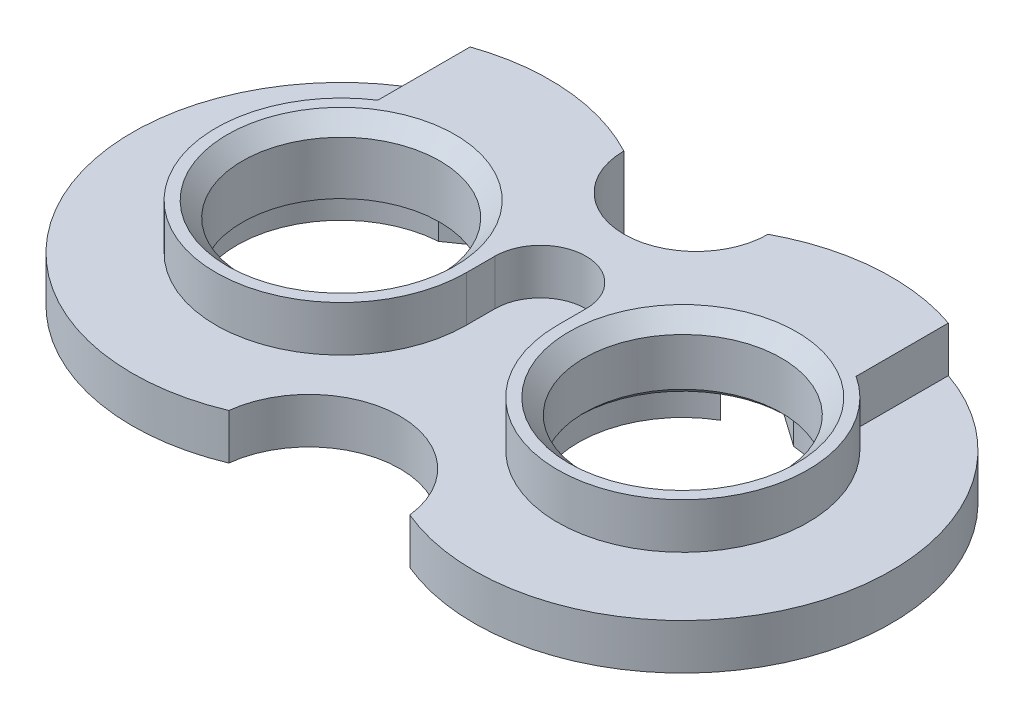
ISO-10303-21;
HEADER;
FILE_DESCRIPTION(('STEP AP214'),'2;1');
FILE_NAME('part.step','',(''),(''),'','','');
FILE_SCHEMA(('AUTOMOTIVE_DESIGN { 1 0 10303 214 1 1 1 1 }'));
ENDSEC;
DATA;
#1=APPLICATION_CONTEXT('core data for automotive mechanical design processes');
#2=APPLICATION_PROTOCOL_DEFINITION('international standard','automotive_design',2000,#1);
#3=PRODUCT_CONTEXT('',#1,'mechanical');
#4=PRODUCT('Part','Part','',(#3));
#5=PRODUCT_RELATED_PRODUCT_CATEGORY('part','',(#4));
#6=PRODUCT_DEFINITION_FORMATION('','',#4);
#7=PRODUCT_DEFINITION_CONTEXT('part definition',#1,'design');
#8=PRODUCT_DEFINITION('design','',#6,#7);
#9=PRODUCT_DEFINITION_SHAPE('','',#8);
#10=(LENGTH_UNIT() NAMED_UNIT(*) SI_UNIT(.MILLI.,.METRE.));
#11=(NAMED_UNIT(*) PLANE_ANGLE_UNIT() SI_UNIT($,.RADIAN.));
#12=(NAMED_UNIT(*) SI_UNIT($,.STERADIAN.) SOLID_ANGLE_UNIT());
#13=UNCERTAINTY_MEASURE_WITH_UNIT(LENGTH_MEASURE(1.E-05),#10,'distance_accuracy_value','');
#14=(GEOMETRIC_REPRESENTATION_CONTEXT(3) GLOBAL_UNCERTAINTY_ASSIGNED_CONTEXT((#13)) GLOBAL_UNIT_ASSIGNED_CONTEXT((#10,
#11,#12)) REPRESENTATION_CONTEXT('',''));
#15=CARTESIAN_POINT('',(0.,0.,0.));
#16=DIRECTION('',(0.,0.,1.));
#17=DIRECTION('',(1.,0.,0.));
#18=AXIS2_PLACEMENT_3D('',#15,#16,#17);
#19=CARTESIAN_POINT('',(22.5,12.,0.));
#20=DIRECTION('',(0.,-1.,0.));
#21=DIRECTION('',(0.,0.,-1.));
#22=AXIS2_PLACEMENT_3D('',#19,#20,#21);
#23=CYLINDRICAL_SURFACE('',#22,13.);
#24=CARTESIAN_POINT('',(22.5,3.75,0.));
#25=DIRECTION('',(0.,1.,0.));
#26=DIRECTION('',(0.,0.,1.));
#27=AXIS2_PLACEMENT_3D('',#24,#25,#26);
#28=CIRCLE('',#27,13.);
#29=CARTESIAN_POINT('',(22.5,3.75,13.));
#30=VERTEX_POINT('',#29);
#31=EDGE_CURVE('E11',#30,#30,#28,.F.);
#32=ORIENTED_EDGE('',*,*,#31,.T.);
#33=EDGE_LOOP('',(#32));
#34=FACE_BOUND('',#33,.T.);
#35=CARTESIAN_POINT('',(22.5,10.,0.));
#36=DIRECTION('',(0.,1.,0.));
#37=DIRECTION('',(0.,0.,1.));
#38=AXIS2_PLACEMENT_3D('',#35,#36,#37);
#39=CIRCLE('',#38,13.);
#40=CARTESIAN_POINT('',(22.5,10.,13.));
#41=VERTEX_POINT('',#40);
#42=EDGE_CURVE('E214',#41,#41,#39,.T.);
#43=ORIENTED_EDGE('',*,*,#42,.T.);
#44=EDGE_LOOP('',(#43));
#45=FACE_BOUND('',#44,.T.);
#46=ADVANCED_FACE('F34',(#34,#45),#23,.F.);
#47=CARTESIAN_POINT('',(-22.5,12.,0.));
#48=DIRECTION('',(0.,-1.,0.));
#49=DIRECTION('',(0.,0.,-1.));
#50=AXIS2_PLACEMENT_3D('',#47,#48,#49);
#51=CYLINDRICAL_SURFACE('',#50,13.);
#52=CARTESIAN_POINT('',(-22.5,10.,0.));
#53=DIRECTION('',(0.,1.,0.));
#54=DIRECTION('',(0.,0.,1.));
#55=AXIS2_PLACEMENT_3D('',#52,#53,#54);
#56=CIRCLE('',#55,13.);
#57=CARTESIAN_POINT('',(-22.5,10.,13.));
#58=VERTEX_POINT('',#57);
#59=EDGE_CURVE('E203',#58,#58,#56,.T.);
#60=ORIENTED_EDGE('',*,*,#59,.T.);
#61=EDGE_LOOP('',(#60));
#62=FACE_BOUND('',#61,.T.);
#63=CARTESIAN_POINT('',(-22.5,3.,0.));
#64=DIRECTION('',(0.,-1.,0.));
#65=DIRECTION('',(0.,0.,-1.));
#66=AXIS2_PLACEMENT_3D('',#63,#64,#65);
#67=CIRCLE('',#66,13.);
#68=CARTESIAN_POINT('',(-22.5,3.,-13.));
#69=VERTEX_POINT('',#68);
#70=EDGE_CURVE('E201',#69,#69,#67,.T.);
#71=ORIENTED_EDGE('',*,*,#70,.T.);
#72=EDGE_LOOP('',(#71));
#73=FACE_BOUND('',#72,.T.);
#74=ADVANCED_FACE('F411',(#62,#73),#51,.F.);
#75=CARTESIAN_POINT('',(0.,12.,0.));
#76=DIRECTION('',(0.,1.,0.));
#77=DIRECTION('',(0.,0.,1.));
#78=AXIS2_PLACEMENT_3D('',#75,#76,#77);
#79=PLANE('',#78);
#80=CARTESIAN_POINT('',(22.5,12.,0.));
#81=DIRECTION('',(0.,1.,0.));
#82=DIRECTION('',(0.,0.,1.));
#83=AXIS2_PLACEMENT_3D('',#80,#81,#82);
#84=CIRCLE('',#83,15.);
#85=CARTESIAN_POINT('',(22.5,12.,15.));
#86=VERTEX_POINT('',#85);
#87=EDGE_CURVE('E208',#86,#86,#84,.F.);
#88=ORIENTED_EDGE('',*,*,#87,.T.);
#89=EDGE_LOOP('',(#88));
#90=FACE_BOUND('',#89,.T.);
#91=CARTESIAN_POINT('',(-22.5,12.,0.));
#92=DIRECTION('',(0.,1.,0.));
#93=DIRECTION('',(0.,0.,1.));
#94=AXIS2_PLACEMENT_3D('',#91,#92,#93);
#95=CIRCLE('',#94,15.);
#96=CARTESIAN_POINT('',(-22.5,12.,15.));
#97=VERTEX_POINT('',#96);
#98=EDGE_CURVE('E211',#97,#97,#95,.F.);
#99=ORIENTED_EDGE('',*,*,#98,.T.);
#100=EDGE_LOOP('',(#99));
#101=FACE_BOUND('',#100,.T.);
#102=DIRECTION('',(0.,0.,1.));
#103=VECTOR('',#102,1.);
#104=CARTESIAN_POINT('',(31.5,12.,-40.));
#105=LINE('',#104,#103);
#106=CARTESIAN_POINT('',(31.5,12.,-25.9855729203726));
#107=VERTEX_POINT('',#106);
#108=CARTESIAN_POINT('',(31.5,12.,-13.8293166859393));
#109=VERTEX_POINT('',#108);
#110=EDGE_CURVE('E284',#107,#109,#105,.T.);
#111=ORIENTED_EDGE('',*,*,#110,.F.);
#112=CARTESIAN_POINT('',(22.5,12.,0.));
#113=DIRECTION('',(0.,1.,0.));
#114=DIRECTION('',(0.,0.,1.));
#115=AXIS2_PLACEMENT_3D('',#112,#113,#114);
#116=CIRCLE('',#115,27.5);
#117=CARTESIAN_POINT('',(9.4999852047791,12.,-24.2332336951559));
#118=VERTEX_POINT('',#117);
#119=EDGE_CURVE('E231',#107,#118,#116,.T.);
#120=ORIENTED_EDGE('',*,*,#119,.T.);
#121=CARTESIAN_POINT('',(0.,12.,-24.25));
#122=DIRECTION('',(0.,1.,0.));
#123=DIRECTION('',(0.,0.,1.));
#124=AXIS2_PLACEMENT_3D('',#121,#122,#123);
#125=CIRCLE('',#124,9.5);
#126=CARTESIAN_POINT('',(-9.4999852047791,12.,-24.2332336951559));
#127=VERTEX_POINT('',#126);
#128=EDGE_CURVE('E239',#127,#118,#125,.T.);
#129=ORIENTED_EDGE('',*,*,#128,.F.);
#130=CARTESIAN_POINT('',(-22.5,12.,0.));
#131=DIRECTION('',(0.,1.,0.));
#132=DIRECTION('',(0.,0.,1.));
#133=AXIS2_PLACEMENT_3D('',#130,#131,#132);
#134=CIRCLE('',#133,27.5);
#135=CARTESIAN_POINT('',(-31.5,12.,-25.9855729203726));
#136=VERTEX_POINT('',#135);
#137=EDGE_CURVE('E226',#127,#136,#134,.T.);
#138=ORIENTED_EDGE('',*,*,#137,.T.);
#139=DIRECTION('',(0.,0.,-1.));
#140=VECTOR('',#139,1.);
#141=CARTESIAN_POINT('',(-31.5,12.,-40.));
#142=LINE('',#141,#140);
#143=CARTESIAN_POINT('',(-31.5,12.,-13.8293166859393));
#144=VERTEX_POINT('',#143);
#145=EDGE_CURVE('E286',#144,#136,#142,.T.);
#146=ORIENTED_EDGE('',*,*,#145,.F.);
#147=CARTESIAN_POINT('',(-22.5,12.,0.));
#148=DIRECTION('',(0.,-1.,0.));
#149=DIRECTION('',(0.,0.,1.));
#150=AXIS2_PLACEMENT_3D('',#147,#148,#149);
#151=CIRCLE('',#150,16.5);
#152=CARTESIAN_POINT('',(-6.,12.,0.));
#153=VERTEX_POINT('',#152);
#154=EDGE_CURVE('E288',#153,#144,#151,.T.);
#155=ORIENTED_EDGE('',*,*,#154,.F.);
#156=DIRECTION('',(0.,0.,1.));
#157=VECTOR('',#156,1.);
#158=CARTESIAN_POINT('',(-6.,12.,0.));
#159=LINE('',#158,#157);
#160=CARTESIAN_POINT('',(-6.,12.,-3.75));
#161=VERTEX_POINT('',#160);
#162=EDGE_CURVE('E271',#161,#153,#159,.T.);
#163=ORIENTED_EDGE('',*,*,#162,.F.);
#164=CARTESIAN_POINT('',(0.,12.,-3.75));
#165=DIRECTION('',(0.,1.,0.));
#166=DIRECTION('',(0.,0.,-1.));
#167=AXIS2_PLACEMENT_3D('',#164,#165,#166);
#168=CIRCLE('',#167,6.);
#169=CARTESIAN_POINT('',(6.,12.,-3.75));
#170=VERTEX_POINT('',#169);
#171=EDGE_CURVE('E275',#170,#161,#168,.T.);
#172=ORIENTED_EDGE('',*,*,#171,.F.);
#173=DIRECTION('',(0.,0.,-1.));
#174=VECTOR('',#173,1.);
#175=CARTESIAN_POINT('',(6.,12.,0.));
#176=LINE('',#175,#174);
#177=CARTESIAN_POINT('',(6.,12.,0.));
#178=VERTEX_POINT('',#177);
#179=EDGE_CURVE('E278',#178,#170,#176,.T.);
#180=ORIENTED_EDGE('',*,*,#179,.F.);
#181=CARTESIAN_POINT('',(22.5,12.,0.));
#182=DIRECTION('',(0.,-1.,0.));
#183=DIRECTION('',(0.,0.,1.));
#184=AXIS2_PLACEMENT_3D('',#181,#182,#183);
#185=CIRCLE('',#184,16.5);
#186=EDGE_CURVE('E281',#109,#178,#185,.T.);
#187=ORIENTED_EDGE('',*,*,#186,.F.);
#188=EDGE_LOOP('',(#111,#120,#129,#138,#146,#155,#163,#172,#180,#187));
#189=FACE_BOUND('',#188,.T.);
#190=ADVANCED_FACE('F409',(#90,#101,#189),#79,.T.);
#191=CARTESIAN_POINT('',(0.,0.,0.));
#192=DIRECTION('',(0.,1.,0.));
#193=DIRECTION('',(0.,0.,1.));
#194=AXIS2_PLACEMENT_3D('',#191,#192,#193);
#195=PLANE('',#194);
#196=DIRECTION('',(-0.819152044288991,0.,-0.573576436351047));
#197=VECTOR('',#196,1.);
#198=CARTESIAN_POINT('',(4.55854138189374,0.,-19.585087734266));
#199=LINE('',#198,#197);
#200=CARTESIAN_POINT('',(15.5691090265812,0.,-11.8754052694879));
#201=VERTEX_POINT('',#200);
#202=CARTESIAN_POINT('',(7.02684365985484,0.,-17.8567638726575));
#203=VERTEX_POINT('',#202);
#204=EDGE_CURVE('E199',#201,#203,#199,.T.);
#205=ORIENTED_EDGE('',*,*,#204,.F.);
#206=CARTESIAN_POINT('',(22.5,0.,0.));
#207=DIRECTION('',(0.,-1.,0.));
#208=DIRECTION('',(0.,0.,-1.));
#209=AXIS2_PLACEMENT_3D('',#206,#207,#208);
#210=CIRCLE('',#209,13.75);
#211=CARTESIAN_POINT('',(23.3941559954784,0.,-13.7208959275898));
#212=VERTEX_POINT('',#211);
#213=EDGE_CURVE('E182',#212,#201,#210,.T.);
#214=ORIENTED_EDGE('',*,*,#213,.F.);
#215=DIRECTION('',(0.819152044288991,0.,0.573576436351047));
#216=VECTOR('',#215,1.);
#217=CARTESIAN_POINT('',(28.4788011072248,0.,-10.1605890912238));
#218=LINE('',#217,#216);
#219=CARTESIAN_POINT('',(9.46809189923089,0.,-23.4720309853739));
#220=VERTEX_POINT('',#219);
#221=EDGE_CURVE('E192',#220,#212,#218,.T.);
#222=ORIENTED_EDGE('',*,*,#221,.F.);
#223=CARTESIAN_POINT('',(0.,0.,-24.25));
#224=DIRECTION('',(0.,1.,0.));
#225=DIRECTION('',(0.,0.,1.));
#226=AXIS2_PLACEMENT_3D('',#223,#224,#225);
#227=CIRCLE('',#226,9.5);
#228=CARTESIAN_POINT('',(9.49998520477911,0.,-24.2332336951559));
#229=VERTEX_POINT('',#228);
#230=EDGE_CURVE('E219',#229,#220,#227,.F.);
#231=ORIENTED_EDGE('',*,*,#230,.F.);
#232=CARTESIAN_POINT('',(22.5,0.,0.));
#233=DIRECTION('',(0.,1.,0.));
#234=DIRECTION('',(0.,0.,1.));
#235=AXIS2_PLACEMENT_3D('',#232,#233,#234);
#236=CIRCLE('',#235,27.5);
#237=CARTESIAN_POINT('',(11.9220182875869,0.,25.3841742605871));
#238=VERTEX_POINT('',#237);
#239=EDGE_CURVE('E224',#238,#229,#236,.T.);
#240=ORIENTED_EDGE('',*,*,#239,.F.);
#241=CARTESIAN_POINT('',(0.,0.,26.75));
#242=DIRECTION('',(0.,1.,0.));
#243=DIRECTION('',(0.,0.,1.));
#244=AXIS2_PLACEMENT_3D('',#241,#242,#243);
#245=CIRCLE('',#244,12.);
#246=CARTESIAN_POINT('',(-11.9220182875869,0.,25.3841742605871));
#247=VERTEX_POINT('',#246);
#248=EDGE_CURVE('E246',#238,#247,#245,.T.);
#249=ORIENTED_EDGE('',*,*,#248,.T.);
#250=CARTESIAN_POINT('',(-22.5,0.,0.));
#251=DIRECTION('',(0.,1.,0.));
#252=DIRECTION('',(0.,0.,1.));
#253=AXIS2_PLACEMENT_3D('',#250,#251,#252);
#254=CIRCLE('',#253,27.5);
#255=CARTESIAN_POINT('',(-9.4999852047791,0.,-24.2332336951559));
#256=VERTEX_POINT('',#255);
#257=EDGE_CURVE('E227',#256,#247,#254,.T.);
#258=ORIENTED_EDGE('',*,*,#257,.F.);
#259=CARTESIAN_POINT('',(-9.4680918992309,0.,-23.4720309853739));
#260=VERTEX_POINT('',#259);
#261=EDGE_CURVE('E223',#260,#256,#227,.F.);
#262=ORIENTED_EDGE('',*,*,#261,.F.);
#263=DIRECTION('',(0.819152044288995,0.,-0.573576436351041));
#264=VECTOR('',#263,1.);
#265=CARTESIAN_POINT('',(-28.4788011072249,0.,-10.160589091224));
#266=LINE('',#265,#264);
#267=CARTESIAN_POINT('',(-23.3941559954787,0.,-13.7208959275898));
#268=VERTEX_POINT('',#267);
#269=EDGE_CURVE('E318',#268,#260,#266,.T.);
#270=ORIENTED_EDGE('',*,*,#269,.F.);
#271=CARTESIAN_POINT('',(-22.5,0.,0.));
#272=DIRECTION('',(0.,-1.,0.));
#273=DIRECTION('',(0.,0.,-1.));
#274=AXIS2_PLACEMENT_3D('',#271,#272,#273);
#275=CIRCLE('',#274,13.75);
#276=CARTESIAN_POINT('',(-15.5691090265813,0.,-11.875405269488));
#277=VERTEX_POINT('',#276);
#278=EDGE_CURVE('E343',#277,#268,#275,.T.);
#279=ORIENTED_EDGE('',*,*,#278,.F.);
#280=DIRECTION('',(-0.819152044288995,0.,0.573576436351042));
#281=VECTOR('',#280,1.);
#282=CARTESIAN_POINT('',(-4.55854138189375,0.,-19.585087734266));
#283=LINE('',#282,#281);
#284=CARTESIAN_POINT('',(-7.02684365985486,0.,-17.8567638726575));
#285=VERTEX_POINT('',#284);
#286=EDGE_CURVE('E321',#285,#277,#283,.T.);
#287=ORIENTED_EDGE('',*,*,#286,.F.);
#288=EDGE_CURVE('E222',#203,#285,#227,.F.);
#289=ORIENTED_EDGE('',*,*,#288,.F.);
#290=EDGE_LOOP('',(#205,#214,#222,#231,#240,#249,#258,#262,#270,#279,#287,#289));
#291=FACE_BOUND('',#290,.T.);
#292=ADVANCED_FACE('F354',(#291),#195,.F.);
#293=CARTESIAN_POINT('',(0.,12.,26.75));
#294=DIRECTION('',(0.,-1.,0.));
#295=DIRECTION('',(0.,0.,-1.));
#296=AXIS2_PLACEMENT_3D('',#293,#294,#295);
#297=CYLINDRICAL_SURFACE('',#296,12.);
#298=DIRECTION('',(0.,-1.,0.));
#299=VECTOR('',#298,1.);
#300=CARTESIAN_POINT('',(11.9220182875869,6.,25.3841742605871));
#301=LINE('',#300,#299);
#302=CARTESIAN_POINT('',(11.9220182875869,6.,25.3841742605871));
#303=VERTEX_POINT('',#302);
#304=EDGE_CURVE('E243',#238,#303,#301,.F.);
#305=ORIENTED_EDGE('',*,*,#304,.T.);
#306=CARTESIAN_POINT('',(0.,6.,26.75));
#307=DIRECTION('',(0.,1.,0.));
#308=DIRECTION('',(0.,0.,1.));
#309=AXIS2_PLACEMENT_3D('',#306,#307,#308);
#310=CIRCLE('',#309,12.);
#311=CARTESIAN_POINT('',(-11.9220182875869,6.,25.3841742605871));
#312=VERTEX_POINT('',#311);
#313=EDGE_CURVE('E217',#303,#312,#310,.T.);
#314=ORIENTED_EDGE('',*,*,#313,.T.);
#315=DIRECTION('',(0.,-1.,0.));
#316=VECTOR('',#315,1.);
#317=CARTESIAN_POINT('',(-11.9220182875869,6.,25.3841742605871));
#318=LINE('',#317,#316);
#319=EDGE_CURVE('E56',#312,#247,#318,.T.);
#320=ORIENTED_EDGE('',*,*,#319,.T.);
#321=ORIENTED_EDGE('',*,*,#248,.F.);
#322=EDGE_LOOP('',(#305,#314,#320,#321));
#323=FACE_BOUND('',#322,.T.);
#324=ADVANCED_FACE('F372',(#323),#297,.F.);
#325=CARTESIAN_POINT('',(-22.5,12.,0.));
#326=DIRECTION('',(0.,-1.,0.));
#327=DIRECTION('',(0.,0.,-1.));
#328=AXIS2_PLACEMENT_3D('',#325,#326,#327);
#329=CYLINDRICAL_SURFACE('',#328,27.5);
#330=CARTESIAN_POINT('',(-22.5,6.,0.));
#331=DIRECTION('',(0.,1.,0.));
#332=DIRECTION('',(0.,0.,1.));
#333=AXIS2_PLACEMENT_3D('',#330,#331,#332);
#334=CIRCLE('',#333,27.5);
#335=CARTESIAN_POINT('',(-31.5,6.,-25.9855729203726));
#336=VERTEX_POINT('',#335);
#337=EDGE_CURVE('E49',#336,#312,#334,.T.);
#338=ORIENTED_EDGE('',*,*,#337,.F.);
#339=DIRECTION('',(0.,-1.,0.));
#340=VECTOR('',#339,1.);
#341=CARTESIAN_POINT('',(-31.5,12.,-25.9855729203726));
#342=LINE('',#341,#340);
#343=EDGE_CURVE('E251',#336,#136,#342,.F.);
#344=ORIENTED_EDGE('',*,*,#343,.T.);
#345=ORIENTED_EDGE('',*,*,#137,.F.);
#346=DIRECTION('',(0.,-1.,0.));
#347=VECTOR('',#346,1.);
#348=CARTESIAN_POINT('',(-9.4999852047791,6.,-24.2332336951559));
#349=LINE('',#348,#347);
#350=EDGE_CURVE('E230',#256,#127,#349,.F.);
#351=ORIENTED_EDGE('',*,*,#350,.F.);
#352=ORIENTED_EDGE('',*,*,#257,.T.);
#353=ORIENTED_EDGE('',*,*,#319,.F.);
#354=EDGE_LOOP('',(#338,#344,#345,#351,#352,#353));
#355=FACE_BOUND('',#354,.T.);
#356=ADVANCED_FACE('F368',(#355),#329,.T.);
#357=CARTESIAN_POINT('',(22.5,12.,0.));
#358=DIRECTION('',(0.,-1.,0.));
#359=DIRECTION('',(0.,0.,-1.));
#360=AXIS2_PLACEMENT_3D('',#357,#358,#359);
#361=CYLINDRICAL_SURFACE('',#360,27.5);
#362=ORIENTED_EDGE('',*,*,#119,.F.);
#363=DIRECTION('',(0.,-1.,0.));
#364=VECTOR('',#363,1.);
#365=CARTESIAN_POINT('',(31.5,12.,-25.9855729203726));
#366=LINE('',#365,#364);
#367=CARTESIAN_POINT('',(31.5,6.,-25.9855729203726));
#368=VERTEX_POINT('',#367);
#369=EDGE_CURVE('E248',#107,#368,#366,.T.);
#370=ORIENTED_EDGE('',*,*,#369,.T.);
#371=CARTESIAN_POINT('',(22.5,6.,0.));
#372=DIRECTION('',(0.,1.,0.));
#373=DIRECTION('',(0.,0.,1.));
#374=AXIS2_PLACEMENT_3D('',#371,#372,#373);
#375=CIRCLE('',#374,27.5);
#376=EDGE_CURVE('E255',#303,#368,#375,.T.);
#377=ORIENTED_EDGE('',*,*,#376,.F.);
#378=ORIENTED_EDGE('',*,*,#304,.F.);
#379=ORIENTED_EDGE('',*,*,#239,.T.);
#380=DIRECTION('',(0.,-1.,0.));
#381=VECTOR('',#380,1.);
#382=CARTESIAN_POINT('',(9.4999852047791,6.,-24.2332336951559));
#383=LINE('',#382,#381);
#384=EDGE_CURVE('E236',#118,#229,#383,.T.);
#385=ORIENTED_EDGE('',*,*,#384,.F.);
#386=EDGE_LOOP('',(#362,#370,#377,#378,#379,#385));
#387=FACE_BOUND('',#386,.T.);
#388=ADVANCED_FACE('F376',(#387),#361,.T.);
#389=CARTESIAN_POINT('',(0.,12.,-24.25));
#390=DIRECTION('',(0.,-1.,0.));
#391=DIRECTION('',(0.,0.,-1.));
#392=AXIS2_PLACEMENT_3D('',#389,#390,#391);
#393=CYLINDRICAL_SURFACE('',#392,9.5);
#394=DIRECTION('',(0.,-1.,0.));
#395=VECTOR('',#394,1.);
#396=CARTESIAN_POINT('',(7.02684365985485,12.,-17.8567638726575));
#397=LINE('',#396,#395);
#398=CARTESIAN_POINT('',(7.02684365985484,3.,-17.8567638726575));
#399=VERTEX_POINT('',#398);
#400=EDGE_CURVE('E324',#203,#399,#397,.F.);
#401=ORIENTED_EDGE('',*,*,#400,.F.);
#402=ORIENTED_EDGE('',*,*,#288,.T.);
#403=DIRECTION('',(0.,-1.,0.));
#404=VECTOR('',#403,1.);
#405=CARTESIAN_POINT('',(-7.02684365985487,12.,-17.8567638726575));
#406=LINE('',#405,#404);
#407=CARTESIAN_POINT('',(-7.02684365985486,3.,-17.8567638726575));
#408=VERTEX_POINT('',#407);
#409=EDGE_CURVE('E311',#408,#285,#406,.T.);
#410=ORIENTED_EDGE('',*,*,#409,.F.);
#411=CARTESIAN_POINT('',(0.,3.,-24.25));
#412=DIRECTION('',(0.,-1.,0.));
#413=DIRECTION('',(0.,0.,-1.));
#414=AXIS2_PLACEMENT_3D('',#411,#412,#413);
#415=CIRCLE('',#414,9.5);
#416=CARTESIAN_POINT('',(-9.4680918992309,3.,-23.4720309853739));
#417=VERTEX_POINT('',#416);
#418=EDGE_CURVE('E314',#408,#417,#415,.T.);
#419=ORIENTED_EDGE('',*,*,#418,.T.);
#420=DIRECTION('',(0.,-1.,0.));
#421=VECTOR('',#420,1.);
#422=CARTESIAN_POINT('',(-9.4680918992309,12.,-23.4720309853739));
#423=LINE('',#422,#421);
#424=EDGE_CURVE('E291',#260,#417,#423,.F.);
#425=ORIENTED_EDGE('',*,*,#424,.F.);
#426=ORIENTED_EDGE('',*,*,#261,.T.);
#427=ORIENTED_EDGE('',*,*,#350,.T.);
#428=ORIENTED_EDGE('',*,*,#128,.T.);
#429=ORIENTED_EDGE('',*,*,#384,.T.);
#430=ORIENTED_EDGE('',*,*,#230,.T.);
#431=DIRECTION('',(0.,-1.,0.));
#432=VECTOR('',#431,1.);
#433=CARTESIAN_POINT('',(9.4680918992309,12.,-23.4720309853739));
#434=LINE('',#433,#432);
#435=CARTESIAN_POINT('',(9.46809189923089,3.,-23.4720309853739));
#436=VERTEX_POINT('',#435);
#437=EDGE_CURVE('E330',#436,#220,#434,.T.);
#438=ORIENTED_EDGE('',*,*,#437,.F.);
#439=CARTESIAN_POINT('',(0.,3.,-24.25));
#440=DIRECTION('',(0.,1.,0.));
#441=DIRECTION('',(0.,0.,1.));
#442=AXIS2_PLACEMENT_3D('',#439,#440,#441);
#443=CIRCLE('',#442,9.5);
#444=EDGE_CURVE('E197',#399,#436,#443,.T.);
#445=ORIENTED_EDGE('',*,*,#444,.F.);
#446=EDGE_LOOP('',(#401,#402,#410,#419,#425,#426,#427,#428,#429,#430,#438,#445));
#447=FACE_BOUND('',#446,.T.);
#448=ADVANCED_FACE('F362',(#447),#393,.F.);
#449=CARTESIAN_POINT('',(31.5,6.,-40.));
#450=DIRECTION('',(-1.,0.,0.));
#451=DIRECTION('',(0.,0.,1.));
#452=AXIS2_PLACEMENT_3D('',#449,#450,#451);
#453=PLANE('',#452);
#454=ORIENTED_EDGE('',*,*,#110,.T.);
#455=DIRECTION('',(0.,1.,0.));
#456=VECTOR('',#455,1.);
#457=CARTESIAN_POINT('',(31.5,6.,-13.8293166859393));
#458=LINE('',#457,#456);
#459=CARTESIAN_POINT('',(31.5,6.,-13.8293166859393));
#460=VERTEX_POINT('',#459);
#461=EDGE_CURVE('E260',#460,#109,#458,.T.);
#462=ORIENTED_EDGE('',*,*,#461,.F.);
#463=DIRECTION('',(0.,0.,1.));
#464=VECTOR('',#463,1.);
#465=CARTESIAN_POINT('',(31.5,6.,-40.));
#466=LINE('',#465,#464);
#467=EDGE_CURVE('E303',#368,#460,#466,.T.);
#468=ORIENTED_EDGE('',*,*,#467,.F.);
#469=ORIENTED_EDGE('',*,*,#369,.F.);
#470=EDGE_LOOP('',(#454,#462,#468,#469));
#471=FACE_BOUND('',#470,.T.);
#472=ADVANCED_FACE('F382',(#471),#453,.F.);
#473=CARTESIAN_POINT('',(-31.5,6.,-40.));
#474=DIRECTION('',(1.,0.,0.));
#475=DIRECTION('',(0.,0.,-1.));
#476=AXIS2_PLACEMENT_3D('',#473,#474,#475);
#477=PLANE('',#476);
#478=DIRECTION('',(0.,0.,-1.));
#479=VECTOR('',#478,1.);
#480=CARTESIAN_POINT('',(-31.5,6.,-40.));
#481=LINE('',#480,#479);
#482=CARTESIAN_POINT('',(-31.5,6.,-13.8293166859393));
#483=VERTEX_POINT('',#482);
#484=EDGE_CURVE('E305',#483,#336,#481,.T.);
#485=ORIENTED_EDGE('',*,*,#484,.F.);
#486=DIRECTION('',(0.,1.,0.));
#487=VECTOR('',#486,1.);
#488=CARTESIAN_POINT('',(-31.5,6.,-13.8293166859393));
#489=LINE('',#488,#487);
#490=EDGE_CURVE('E258',#483,#144,#489,.T.);
#491=ORIENTED_EDGE('',*,*,#490,.T.);
#492=ORIENTED_EDGE('',*,*,#145,.T.);
#493=ORIENTED_EDGE('',*,*,#343,.F.);
#494=EDGE_LOOP('',(#485,#491,#492,#493));
#495=FACE_BOUND('',#494,.T.);
#496=ADVANCED_FACE('F407',(#495),#477,.F.);
#497=CARTESIAN_POINT('',(-22.5,6.,0.));
#498=DIRECTION('',(0.,1.,0.));
#499=DIRECTION('',(0.,0.,1.));
#500=AXIS2_PLACEMENT_3D('',#497,#498,#499);
#501=PLANE('',#500);
#502=ORIENTED_EDGE('',*,*,#337,.T.);
#503=ORIENTED_EDGE('',*,*,#313,.F.);
#504=ORIENTED_EDGE('',*,*,#376,.T.);
#505=ORIENTED_EDGE('',*,*,#467,.T.);
#506=CARTESIAN_POINT('',(22.5,6.,0.));
#507=DIRECTION('',(0.,-1.,0.));
#508=DIRECTION('',(0.,0.,1.));
#509=AXIS2_PLACEMENT_3D('',#506,#507,#508);
#510=CIRCLE('',#509,16.5);
#511=CARTESIAN_POINT('',(6.,6.,0.));
#512=VERTEX_POINT('',#511);
#513=EDGE_CURVE('E300',#460,#512,#510,.T.);
#514=ORIENTED_EDGE('',*,*,#513,.T.);
#515=DIRECTION('',(0.,0.,-1.));
#516=VECTOR('',#515,1.);
#517=CARTESIAN_POINT('',(6.,6.,0.));
#518=LINE('',#517,#516);
#519=CARTESIAN_POINT('',(6.,6.,-3.75));
#520=VERTEX_POINT('',#519);
#521=EDGE_CURVE('E297',#512,#520,#518,.T.);
#522=ORIENTED_EDGE('',*,*,#521,.T.);
#523=CARTESIAN_POINT('',(0.,6.,-3.75));
#524=DIRECTION('',(0.,1.,0.));
#525=DIRECTION('',(0.,0.,-1.));
#526=AXIS2_PLACEMENT_3D('',#523,#524,#525);
#527=CIRCLE('',#526,6.);
#528=CARTESIAN_POINT('',(-6.,6.,-3.75));
#529=VERTEX_POINT('',#528);
#530=EDGE_CURVE('E294',#520,#529,#527,.T.);
#531=ORIENTED_EDGE('',*,*,#530,.T.);
#532=DIRECTION('',(0.,0.,1.));
#533=VECTOR('',#532,1.);
#534=CARTESIAN_POINT('',(-6.,6.,0.));
#535=LINE('',#534,#533);
#536=CARTESIAN_POINT('',(-6.,6.,0.));
#537=VERTEX_POINT('',#536);
#538=EDGE_CURVE('E261',#529,#537,#535,.T.);
#539=ORIENTED_EDGE('',*,*,#538,.T.);
#540=CARTESIAN_POINT('',(-22.5,6.,0.));
#541=DIRECTION('',(0.,-1.,0.));
#542=DIRECTION('',(0.,0.,1.));
#543=AXIS2_PLACEMENT_3D('',#540,#541,#542);
#544=CIRCLE('',#543,16.5);
#545=EDGE_CURVE('E274',#537,#483,#544,.T.);
#546=ORIENTED_EDGE('',*,*,#545,.T.);
#547=ORIENTED_EDGE('',*,*,#484,.T.);
#548=EDGE_LOOP('',(#502,#503,#504,#505,#514,#522,#531,#539,#546,#547));
#549=FACE_BOUND('',#548,.T.);
#550=ADVANCED_FACE('F379',(#549),#501,.T.);
#551=CARTESIAN_POINT('',(-22.5,6.,0.));
#552=DIRECTION('',(0.,1.,0.));
#553=DIRECTION('',(0.,0.,1.));
#554=AXIS2_PLACEMENT_3D('',#551,#552,#553);
#555=CYLINDRICAL_SURFACE('',#554,16.5);
#556=ORIENTED_EDGE('',*,*,#154,.T.);
#557=ORIENTED_EDGE('',*,*,#490,.F.);
#558=ORIENTED_EDGE('',*,*,#545,.F.);
#559=DIRECTION('',(0.,1.,0.));
#560=VECTOR('',#559,1.);
#561=CARTESIAN_POINT('',(-6.,6.,0.));
#562=LINE('',#561,#560);
#563=EDGE_CURVE('E257',#537,#153,#562,.T.);
#564=ORIENTED_EDGE('',*,*,#563,.T.);
#565=EDGE_LOOP('',(#556,#557,#558,#564));
#566=FACE_BOUND('',#565,.T.);
#567=ADVANCED_FACE('F404',(#566),#555,.T.);
#568=CARTESIAN_POINT('',(-6.,6.,0.));
#569=DIRECTION('',(-1.,0.,0.));
#570=DIRECTION('',(0.,0.,1.));
#571=AXIS2_PLACEMENT_3D('',#568,#569,#570);
#572=PLANE('',#571);
#573=ORIENTED_EDGE('',*,*,#162,.T.);
#574=ORIENTED_EDGE('',*,*,#563,.F.);
#575=ORIENTED_EDGE('',*,*,#538,.F.);
#576=DIRECTION('',(0.,1.,0.));
#577=VECTOR('',#576,1.);
#578=CARTESIAN_POINT('',(-6.,6.,-3.75));
#579=LINE('',#578,#577);
#580=EDGE_CURVE('E268',#529,#161,#579,.T.);
#581=ORIENTED_EDGE('',*,*,#580,.T.);
#582=EDGE_LOOP('',(#573,#574,#575,#581));
#583=FACE_BOUND('',#582,.T.);
#584=ADVANCED_FACE('F399',(#583),#572,.F.);
#585=CARTESIAN_POINT('',(0.,6.,-3.75));
#586=DIRECTION('',(0.,1.,0.));
#587=DIRECTION('',(0.,0.,1.));
#588=AXIS2_PLACEMENT_3D('',#585,#586,#587);
#589=CYLINDRICAL_SURFACE('',#588,6.);
#590=ORIENTED_EDGE('',*,*,#171,.T.);
#591=ORIENTED_EDGE('',*,*,#580,.F.);
#592=ORIENTED_EDGE('',*,*,#530,.F.);
#593=DIRECTION('',(0.,1.,0.));
#594=VECTOR('',#593,1.);
#595=CARTESIAN_POINT('',(6.,6.,-3.75));
#596=LINE('',#595,#594);
#597=EDGE_CURVE('E266',#520,#170,#596,.T.);
#598=ORIENTED_EDGE('',*,*,#597,.T.);
#599=EDGE_LOOP('',(#590,#591,#592,#598));
#600=FACE_BOUND('',#599,.T.);
#601=ADVANCED_FACE('F396',(#600),#589,.F.);
#602=CARTESIAN_POINT('',(6.,6.,0.));
#603=DIRECTION('',(1.,0.,0.));
#604=DIRECTION('',(0.,0.,-1.));
#605=AXIS2_PLACEMENT_3D('',#602,#603,#604);
#606=PLANE('',#605);
#607=ORIENTED_EDGE('',*,*,#179,.T.);
#608=ORIENTED_EDGE('',*,*,#597,.F.);
#609=ORIENTED_EDGE('',*,*,#521,.F.);
#610=DIRECTION('',(0.,1.,0.));
#611=VECTOR('',#610,1.);
#612=CARTESIAN_POINT('',(6.,6.,0.));
#613=LINE('',#612,#611);
#614=EDGE_CURVE('E264',#512,#178,#613,.T.);
#615=ORIENTED_EDGE('',*,*,#614,.T.);
#616=EDGE_LOOP('',(#607,#608,#609,#615));
#617=FACE_BOUND('',#616,.T.);
#618=ADVANCED_FACE('F392',(#617),#606,.F.);
#619=CARTESIAN_POINT('',(22.5,6.,0.));
#620=DIRECTION('',(0.,1.,0.));
#621=DIRECTION('',(0.,0.,1.));
#622=AXIS2_PLACEMENT_3D('',#619,#620,#621);
#623=CYLINDRICAL_SURFACE('',#622,16.5);
#624=ORIENTED_EDGE('',*,*,#186,.T.);
#625=ORIENTED_EDGE('',*,*,#614,.F.);
#626=ORIENTED_EDGE('',*,*,#513,.F.);
#627=ORIENTED_EDGE('',*,*,#461,.T.);
#628=EDGE_LOOP('',(#624,#625,#626,#627));
#629=FACE_BOUND('',#628,.T.);
#630=ADVANCED_FACE('F387',(#629),#623,.T.);
#631=CARTESIAN_POINT('',(22.5,10.,0.));
#632=DIRECTION('',(0.,1.,0.));
#633=DIRECTION('',(0.,0.,1.));
#634=AXIS2_PLACEMENT_3D('',#631,#632,#633);
#635=CONICAL_SURFACE('',#634,13.,0.785398163397451);
#636=ORIENTED_EDGE('',*,*,#87,.F.);
#637=EDGE_LOOP('',(#636));
#638=FACE_BOUND('',#637,.T.);
#639=ORIENTED_EDGE('',*,*,#42,.F.);
#640=EDGE_LOOP('',(#639));
#641=FACE_BOUND('',#640,.T.);
#642=ADVANCED_FACE('F443',(#638,#641),#635,.F.);
#643=CARTESIAN_POINT('',(-22.5,10.,0.));
#644=DIRECTION('',(0.,1.,0.));
#645=DIRECTION('',(0.,0.,1.));
#646=AXIS2_PLACEMENT_3D('',#643,#644,#645);
#647=CONICAL_SURFACE('',#646,13.,0.785398163397448);
#648=ORIENTED_EDGE('',*,*,#98,.F.);
#649=EDGE_LOOP('',(#648));
#650=FACE_BOUND('',#649,.T.);
#651=ORIENTED_EDGE('',*,*,#59,.F.);
#652=EDGE_LOOP('',(#651));
#653=FACE_BOUND('',#652,.T.);
#654=ADVANCED_FACE('F462',(#650,#653),#647,.F.);
#655=CARTESIAN_POINT('',(-28.4788011072249,3.,-10.160589091224));
#656=DIRECTION('',(-0.573576436351042,0.,-0.819152044288995));
#657=DIRECTION('',(-0.819152044288995,0.,0.573576436351042));
#658=AXIS2_PLACEMENT_3D('',#655,#656,#657);
#659=PLANE('',#658);
#660=DIRECTION('',(0.819152044288995,0.,-0.573576436351041));
#661=VECTOR('',#660,1.);
#662=CARTESIAN_POINT('',(-28.4788011072249,3.,-10.160589091224));
#663=LINE('',#662,#661);
#664=CARTESIAN_POINT('',(-23.3941559954787,3.,-13.7208959275898));
#665=VERTEX_POINT('',#664);
#666=EDGE_CURVE('E317',#665,#417,#663,.T.);
#667=ORIENTED_EDGE('',*,*,#666,.F.);
#668=DIRECTION('',(0.,-1.,0.));
#669=VECTOR('',#668,1.);
#670=CARTESIAN_POINT('',(-23.3941559954787,3.,-13.7208959275898));
#671=LINE('',#670,#669);
#672=EDGE_CURVE('E335',#665,#268,#671,.T.);
#673=ORIENTED_EDGE('',*,*,#672,.T.);
#674=ORIENTED_EDGE('',*,*,#269,.T.);
#675=ORIENTED_EDGE('',*,*,#424,.T.);
#676=EDGE_LOOP('',(#667,#673,#674,#675));
#677=FACE_BOUND('',#676,.T.);
#678=ADVANCED_FACE('F465',(#677),#659,.F.);
#679=CARTESIAN_POINT('',(-4.55854138189375,3.,-19.585087734266));
#680=DIRECTION('',(0.573576436351042,0.,0.819152044288995));
#681=DIRECTION('',(0.819152044288995,0.,-0.573576436351042));
#682=AXIS2_PLACEMENT_3D('',#679,#680,#681);
#683=PLANE('',#682);
#684=ORIENTED_EDGE('',*,*,#286,.T.);
#685=DIRECTION('',(0.,-1.,0.));
#686=VECTOR('',#685,1.);
#687=CARTESIAN_POINT('',(-15.5691090265813,3.,-11.875405269488));
#688=LINE('',#687,#686);
#689=CARTESIAN_POINT('',(-15.5691090265813,3.,-11.875405269488));
#690=VERTEX_POINT('',#689);
#691=EDGE_CURVE('E339',#277,#690,#688,.F.);
#692=ORIENTED_EDGE('',*,*,#691,.T.);
#693=DIRECTION('',(-0.819152044288995,0.,0.573576436351042));
#694=VECTOR('',#693,1.);
#695=CARTESIAN_POINT('',(-4.55854138189375,3.,-19.585087734266));
#696=LINE('',#695,#694);
#697=EDGE_CURVE('E320',#408,#690,#696,.T.);
#698=ORIENTED_EDGE('',*,*,#697,.F.);
#699=ORIENTED_EDGE('',*,*,#409,.T.);
#700=EDGE_LOOP('',(#684,#692,#698,#699));
#701=FACE_BOUND('',#700,.T.);
#702=ADVANCED_FACE('F430',(#701),#683,.F.);
#703=CARTESIAN_POINT('',(0.,3.,0.));
#704=DIRECTION('',(0.,-1.,0.));
#705=DIRECTION('',(0.,0.,-1.));
#706=AXIS2_PLACEMENT_3D('',#703,#704,#705);
#707=PLANE('',#706);
#708=CARTESIAN_POINT('',(-22.5,3.,0.));
#709=DIRECTION('',(0.,-1.,0.));
#710=DIRECTION('',(0.,0.,-1.));
#711=AXIS2_PLACEMENT_3D('',#708,#709,#710);
#712=CIRCLE('',#711,13.75);
#713=EDGE_CURVE('E342',#690,#665,#712,.T.);
#714=ORIENTED_EDGE('',*,*,#713,.T.);
#715=ORIENTED_EDGE('',*,*,#666,.T.);
#716=ORIENTED_EDGE('',*,*,#418,.F.);
#717=ORIENTED_EDGE('',*,*,#697,.T.);
#718=EDGE_LOOP('',(#714,#715,#716,#717));
#719=FACE_BOUND('',#718,.T.);
#720=ORIENTED_EDGE('',*,*,#70,.F.);
#721=EDGE_LOOP('',(#720));
#722=FACE_BOUND('',#721,.T.);
#723=ADVANCED_FACE('F477',(#719,#722),#707,.T.);
#724=CARTESIAN_POINT('',(4.55854138189374,3.,-19.585087734266));
#725=DIRECTION('',(-0.573576436351047,0.,0.819152044288991));
#726=DIRECTION('',(0.819152044288991,0.,0.573576436351047));
#727=AXIS2_PLACEMENT_3D('',#724,#725,#726);
#728=PLANE('',#727);
#729=DIRECTION('',(-0.819152044288991,0.,-0.573576436351047));
#730=VECTOR('',#729,1.);
#731=CARTESIAN_POINT('',(4.55854138189374,3.,-19.585087734266));
#732=LINE('',#731,#730);
#733=CARTESIAN_POINT('',(15.5691090265812,3.,-11.8754052694879));
#734=VERTEX_POINT('',#733);
#735=EDGE_CURVE('E198',#734,#399,#732,.T.);
#736=ORIENTED_EDGE('',*,*,#735,.F.);
#737=DIRECTION('',(0.,-1.,0.));
#738=VECTOR('',#737,1.);
#739=CARTESIAN_POINT('',(15.5691090265812,3.,-11.8754052694879));
#740=LINE('',#739,#738);
#741=EDGE_CURVE('E177',#734,#201,#740,.T.);
#742=ORIENTED_EDGE('',*,*,#741,.T.);
#743=ORIENTED_EDGE('',*,*,#204,.T.);
#744=ORIENTED_EDGE('',*,*,#400,.T.);
#745=EDGE_LOOP('',(#736,#742,#743,#744));
#746=FACE_BOUND('',#745,.T.);
#747=ADVANCED_FACE('F351',(#746),#728,.F.);
#748=CARTESIAN_POINT('',(28.4788011072248,3.,-10.1605890912238));
#749=DIRECTION('',(0.573576436351047,0.,-0.819152044288991));
#750=DIRECTION('',(-0.819152044288991,0.,-0.573576436351047));
#751=AXIS2_PLACEMENT_3D('',#748,#749,#750);
#752=PLANE('',#751);
#753=ORIENTED_EDGE('',*,*,#221,.T.);
#754=DIRECTION('',(0.,-1.,0.));
#755=VECTOR('',#754,1.);
#756=CARTESIAN_POINT('',(23.3941559954784,3.,-13.7208959275898));
#757=LINE('',#756,#755);
#758=CARTESIAN_POINT('',(23.3941559954784,3.,-13.7208959275898));
#759=VERTEX_POINT('',#758);
#760=EDGE_CURVE('E174',#212,#759,#757,.F.);
#761=ORIENTED_EDGE('',*,*,#760,.T.);
#762=DIRECTION('',(0.819152044288991,0.,0.573576436351047));
#763=VECTOR('',#762,1.);
#764=CARTESIAN_POINT('',(28.4788011072248,3.,-10.1605890912238));
#765=LINE('',#764,#763);
#766=EDGE_CURVE('E189',#436,#759,#765,.T.);
#767=ORIENTED_EDGE('',*,*,#766,.F.);
#768=ORIENTED_EDGE('',*,*,#437,.T.);
#769=EDGE_LOOP('',(#753,#761,#767,#768));
#770=FACE_BOUND('',#769,.T.);
#771=ADVANCED_FACE('F188',(#770),#752,.F.);
#772=CARTESIAN_POINT('',(0.,3.,0.));
#773=DIRECTION('',(0.,1.,0.));
#774=DIRECTION('',(0.,0.,1.));
#775=AXIS2_PLACEMENT_3D('',#772,#773,#774);
#776=PLANE('',#775);
#777=ORIENTED_EDGE('',*,*,#766,.T.);
#778=CARTESIAN_POINT('',(22.5,3.,0.));
#779=DIRECTION('',(0.,1.,0.));
#780=DIRECTION('',(0.,0.,1.));
#781=AXIS2_PLACEMENT_3D('',#778,#779,#780);
#782=CIRCLE('',#781,13.75);
#783=EDGE_CURVE('E42',#759,#734,#782,.T.);
#784=ORIENTED_EDGE('',*,*,#783,.T.);
#785=ORIENTED_EDGE('',*,*,#735,.T.);
#786=ORIENTED_EDGE('',*,*,#444,.T.);
#787=EDGE_LOOP('',(#777,#784,#785,#786));
#788=FACE_BOUND('',#787,.T.);
#789=ADVANCED_FACE('F195',(#788),#776,.F.);
#790=CARTESIAN_POINT('',(-22.5,3.,0.));
#791=DIRECTION('',(0.,-1.,0.));
#792=DIRECTION('',(0.,0.,-1.));
#793=AXIS2_PLACEMENT_3D('',#790,#791,#792);
#794=CYLINDRICAL_SURFACE('',#793,13.75);
#795=ORIENTED_EDGE('',*,*,#713,.F.);
#796=ORIENTED_EDGE('',*,*,#691,.F.);
#797=ORIENTED_EDGE('',*,*,#278,.T.);
#798=ORIENTED_EDGE('',*,*,#672,.F.);
#799=EDGE_LOOP('',(#795,#796,#797,#798));
#800=FACE_BOUND('',#799,.T.);
#801=ADVANCED_FACE('F492',(#800),#794,.F.);
#802=CARTESIAN_POINT('',(22.5,3.,0.));
#803=DIRECTION('',(0.,-1.,0.));
#804=DIRECTION('',(0.,0.,-1.));
#805=AXIS2_PLACEMENT_3D('',#802,#803,#804);
#806=CYLINDRICAL_SURFACE('',#805,13.75);
#807=CARTESIAN_POINT('',(22.5,3.,0.));
#808=DIRECTION('',(0.,-1.,0.));
#809=DIRECTION('',(0.,0.,-1.));
#810=AXIS2_PLACEMENT_3D('',#807,#808,#809);
#811=CIRCLE('',#810,13.75);
#812=EDGE_CURVE('E171',#759,#734,#811,.T.);
#813=ORIENTED_EDGE('',*,*,#812,.F.);
#814=ORIENTED_EDGE('',*,*,#760,.F.);
#815=ORIENTED_EDGE('',*,*,#213,.T.);
#816=ORIENTED_EDGE('',*,*,#741,.F.);
#817=EDGE_LOOP('',(#813,#814,#815,#816));
#818=FACE_BOUND('',#817,.T.);
#819=ADVANCED_FACE('F173',(#818),#806,.F.);
#820=CARTESIAN_POINT('',(22.5,3.,0.));
#821=DIRECTION('',(0.,-1.,0.));
#822=DIRECTION('',(0.,0.,-1.));
#823=AXIS2_PLACEMENT_3D('',#820,#821,#822);
#824=CONICAL_SURFACE('',#823,13.75,0.785398163397441);
#825=ORIENTED_EDGE('',*,*,#31,.F.);
#826=EDGE_LOOP('',(#825));
#827=FACE_BOUND('',#826,.T.);
#828=ORIENTED_EDGE('',*,*,#812,.T.);
#829=ORIENTED_EDGE('',*,*,#783,.F.);
#830=EDGE_LOOP('',(#828,#829));
#831=FACE_BOUND('',#830,.T.);
#832=ADVANCED_FACE('F36',(#827,#831),#824,.F.);
#833=CLOSED_SHELL('',(#46,#74,#190,#292,#324,#356,#388,#448,#472,#496,#550,#567,#584,#601,#618,
#630,#642,#654,#678,#702,#723,#747,#771,#789,#801,#819,#832));
#834=MANIFOLD_SOLID_BREP('B2',#833);
#835=ADVANCED_BREP_SHAPE_REPRESENTATION('',(#18,#834),#14);
#836=SHAPE_DEFINITION_REPRESENTATION(#9,#835);
ENDSEC;
END-ISO-10303-21;
